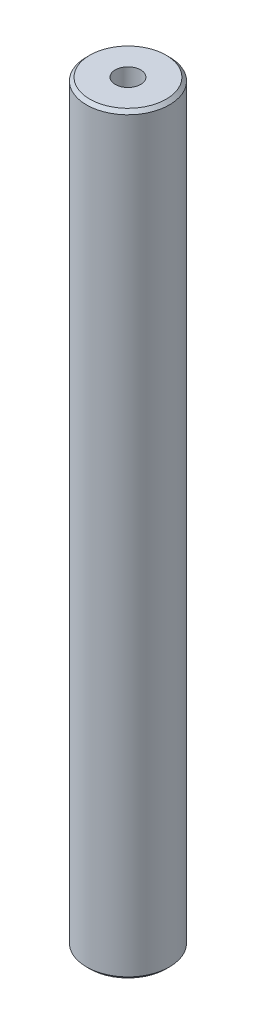
ISO-10303-21;
HEADER;
FILE_DESCRIPTION(('STEP AP214'),'2;1');
FILE_NAME('part.step','',(''),(''),'','','');
FILE_SCHEMA(('AUTOMOTIVE_DESIGN { 1 0 10303 214 1 1 1 1 }'));
ENDSEC;
DATA;
#1=APPLICATION_CONTEXT('core data for automotive mechanical design processes');
#2=APPLICATION_PROTOCOL_DEFINITION('international standard','automotive_design',2000,#1);
#3=PRODUCT_CONTEXT('',#1,'mechanical');
#4=PRODUCT('Part','Part','',(#3));
#5=PRODUCT_RELATED_PRODUCT_CATEGORY('part','',(#4));
#6=PRODUCT_DEFINITION_FORMATION('','',#4);
#7=PRODUCT_DEFINITION_CONTEXT('part definition',#1,'design');
#8=PRODUCT_DEFINITION('design','',#6,#7);
#9=PRODUCT_DEFINITION_SHAPE('','',#8);
#10=(LENGTH_UNIT() NAMED_UNIT(*) SI_UNIT(.MILLI.,.METRE.));
#11=(NAMED_UNIT(*) PLANE_ANGLE_UNIT() SI_UNIT($,.RADIAN.));
#12=(NAMED_UNIT(*) SI_UNIT($,.STERADIAN.) SOLID_ANGLE_UNIT());
#13=UNCERTAINTY_MEASURE_WITH_UNIT(LENGTH_MEASURE(1.E-05),#10,'distance_accuracy_value','');
#14=(GEOMETRIC_REPRESENTATION_CONTEXT(3) GLOBAL_UNCERTAINTY_ASSIGNED_CONTEXT((#13)) GLOBAL_UNIT_ASSIGNED_CONTEXT((#10,
#11,#12)) REPRESENTATION_CONTEXT('',''));
#15=CARTESIAN_POINT('',(0.,0.,0.));
#16=DIRECTION('',(0.,0.,1.));
#17=DIRECTION('',(1.,0.,0.));
#18=AXIS2_PLACEMENT_3D('',#15,#16,#17);
#19=CARTESIAN_POINT('',(0.,590.439226282028,0.));
#20=DIRECTION('',(0.,-1.,0.));
#21=DIRECTION('',(0.,0.,-1.));
#22=AXIS2_PLACEMENT_3D('',#19,#20,#21);
#23=CYLINDRICAL_SURFACE('',#22,32.5);
#24=CARTESIAN_POINT('',(0.,587.854864633849,0.));
#25=DIRECTION('',(0.,1.,0.));
#26=DIRECTION('',(0.,0.,1.));
#27=AXIS2_PLACEMENT_3D('',#24,#25,#26);
#28=CIRCLE('',#27,32.5);
#29=CARTESIAN_POINT('',(0.,587.854864633849,32.5));
#30=VERTEX_POINT('',#29);
#31=EDGE_CURVE('E50',#30,#30,#28,.F.);
#32=ORIENTED_EDGE('',*,*,#31,.T.);
#33=EDGE_LOOP('',(#32));
#34=FACE_BOUND('',#33,.T.);
#35=CARTESIAN_POINT('',(0.,2.58244998799628,0.));
#36=DIRECTION('',(0.,1.,0.));
#37=DIRECTION('',(0.,0.,1.));
#38=AXIS2_PLACEMENT_3D('',#35,#36,#37);
#39=CIRCLE('',#38,32.5);
#40=CARTESIAN_POINT('',(0.,2.58244998799628,32.5));
#41=VERTEX_POINT('',#40);
#42=EDGE_CURVE('E51',#41,#41,#39,.T.);
#43=ORIENTED_EDGE('',*,*,#42,.T.);
#44=EDGE_LOOP('',(#43));
#45=FACE_BOUND('',#44,.T.);
#46=ADVANCED_FACE('F39',(#34,#45),#23,.T.);
#47=CARTESIAN_POINT('',(0.,590.439226282028,0.));
#48=DIRECTION('',(0.,1.,0.));
#49=DIRECTION('',(0.,0.,1.));
#50=AXIS2_PLACEMENT_3D('',#47,#48,#49);
#51=PLANE('',#50);
#52=CARTESIAN_POINT('',(0.,590.439226282028,0.));
#53=DIRECTION('',(0.,1.,0.));
#54=DIRECTION('',(0.,0.,1.));
#55=AXIS2_PLACEMENT_3D('',#52,#53,#54);
#56=CIRCLE('',#55,29.9175500120037);
#57=CARTESIAN_POINT('',(0.,590.439226282028,29.9175500120037));
#58=VERTEX_POINT('',#57);
#59=EDGE_CURVE('E54',#58,#58,#56,.T.);
#60=ORIENTED_EDGE('',*,*,#59,.T.);
#61=EDGE_LOOP('',(#60));
#62=FACE_BOUND('',#61,.T.);
#63=CARTESIAN_POINT('',(0.,590.439226282028,0.));
#64=DIRECTION('',(0.,1.,0.));
#65=DIRECTION('',(0.,0.,1.));
#66=AXIS2_PLACEMENT_3D('',#63,#64,#65);
#67=CIRCLE('',#66,9.95408265242101);
#68=CARTESIAN_POINT('',(0.,590.439226282028,9.95408265242101));
#69=VERTEX_POINT('',#68);
#70=EDGE_CURVE('E58',#69,#69,#67,.T.);
#71=ORIENTED_EDGE('',*,*,#70,.F.);
#72=EDGE_LOOP('',(#71));
#73=FACE_BOUND('',#72,.T.);
#74=ADVANCED_FACE('F69',(#62,#73),#51,.T.);
#75=CARTESIAN_POINT('',(0.,0.,0.));
#76=DIRECTION('',(0.,1.,0.));
#77=DIRECTION('',(0.,0.,1.));
#78=AXIS2_PLACEMENT_3D('',#75,#76,#77);
#79=PLANE('',#78);
#80=CARTESIAN_POINT('',(0.,0.,0.));
#81=DIRECTION('',(0.,1.,0.));
#82=DIRECTION('',(0.,0.,1.));
#83=AXIS2_PLACEMENT_3D('',#80,#81,#82);
#84=CIRCLE('',#83,29.9156383518212);
#85=CARTESIAN_POINT('',(0.,0.,29.9156383518212));
#86=VERTEX_POINT('',#85);
#87=EDGE_CURVE('E10',#86,#86,#84,.F.);
#88=ORIENTED_EDGE('',*,*,#87,.T.);
#89=EDGE_LOOP('',(#88));
#90=FACE_BOUND('',#89,.T.);
#91=CARTESIAN_POINT('',(0.,0.,0.));
#92=DIRECTION('',(0.,1.,0.));
#93=DIRECTION('',(0.,0.,1.));
#94=AXIS2_PLACEMENT_3D('',#91,#92,#93);
#95=CIRCLE('',#94,9.95408265242101);
#96=CARTESIAN_POINT('',(0.,0.,9.95408265242101));
#97=VERTEX_POINT('',#96);
#98=EDGE_CURVE('E63',#97,#97,#95,.T.);
#99=ORIENTED_EDGE('',*,*,#98,.T.);
#100=EDGE_LOOP('',(#99));
#101=FACE_BOUND('',#100,.T.);
#102=ADVANCED_FACE('F75',(#90,#101),#79,.F.);
#103=CARTESIAN_POINT('',(0.,590.439226282028,0.));
#104=DIRECTION('',(0.,-1.,0.));
#105=DIRECTION('',(0.,0.,-1.));
#106=AXIS2_PLACEMENT_3D('',#103,#104,#105);
#107=CYLINDRICAL_SURFACE('',#106,9.95408265242101);
#108=ORIENTED_EDGE('',*,*,#70,.T.);
#109=EDGE_LOOP('',(#108));
#110=FACE_BOUND('',#109,.T.);
#111=ORIENTED_EDGE('',*,*,#98,.F.);
#112=EDGE_LOOP('',(#111));
#113=FACE_BOUND('',#112,.T.);
#114=ADVANCED_FACE('F70',(#110,#113),#107,.F.);
#115=CARTESIAN_POINT('',(0.,590.439226282028,0.));
#116=DIRECTION('',(0.,-1.,0.));
#117=DIRECTION('',(0.,0.,-1.));
#118=AXIS2_PLACEMENT_3D('',#115,#116,#117);
#119=CONICAL_SURFACE('',#118,29.9175500120037,0.785028175050689);
#120=ORIENTED_EDGE('',*,*,#31,.F.);
#121=EDGE_LOOP('',(#120));
#122=FACE_BOUND('',#121,.T.);
#123=ORIENTED_EDGE('',*,*,#59,.F.);
#124=EDGE_LOOP('',(#123));
#125=FACE_BOUND('',#124,.T.);
#126=ADVANCED_FACE('F81',(#122,#125),#119,.T.);
#127=CARTESIAN_POINT('',(0.,2.58244998799628,0.));
#128=DIRECTION('',(0.,1.,0.));
#129=DIRECTION('',(0.,0.,1.));
#130=AXIS2_PLACEMENT_3D('',#127,#128,#129);
#131=CONICAL_SURFACE('',#130,32.5,0.785768151744218);
#132=ORIENTED_EDGE('',*,*,#87,.F.);
#133=EDGE_LOOP('',(#132));
#134=FACE_BOUND('',#133,.T.);
#135=ORIENTED_EDGE('',*,*,#42,.F.);
#136=EDGE_LOOP('',(#135));
#137=FACE_BOUND('',#136,.T.);
#138=ADVANCED_FACE('F45',(#134,#137),#131,.T.);
#139=CLOSED_SHELL('',(#46,#74,#102,#114,#126,#138));
#140=MANIFOLD_SOLID_BREP('B2',#139);
#141=ADVANCED_BREP_SHAPE_REPRESENTATION('',(#18,#140),#14);
#142=SHAPE_DEFINITION_REPRESENTATION(#9,#141);
ENDSEC;
END-ISO-10303-21;
